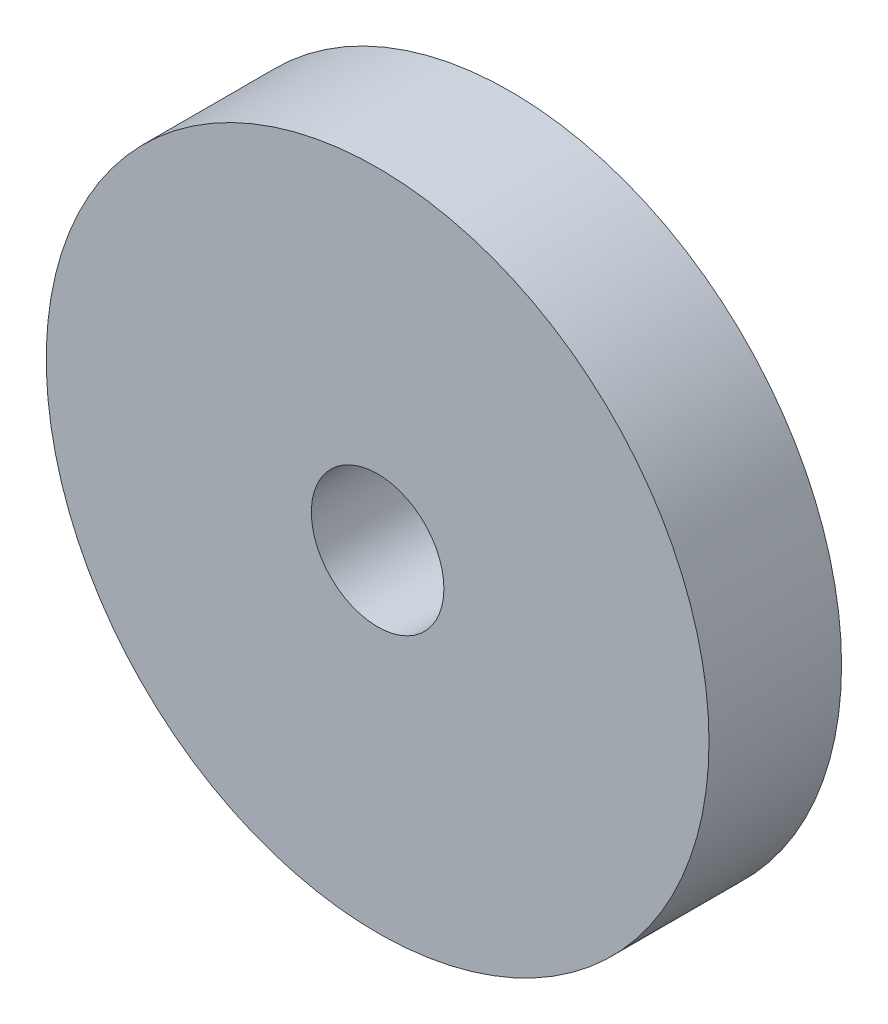
ISO-10303-21;
HEADER;
FILE_DESCRIPTION(('STEP AP214'),'2;1');
FILE_NAME('part.step','',(''),(''),'','','');
FILE_SCHEMA(('AUTOMOTIVE_DESIGN { 1 0 10303 214 1 1 1 1 }'));
ENDSEC;
DATA;
#1=APPLICATION_CONTEXT('core data for automotive mechanical design processes');
#2=APPLICATION_PROTOCOL_DEFINITION('international standard','automotive_design',2000,#1);
#3=PRODUCT_CONTEXT('',#1,'mechanical');
#4=PRODUCT('Part','Part','',(#3));
#5=PRODUCT_RELATED_PRODUCT_CATEGORY('part','',(#4));
#6=PRODUCT_DEFINITION_FORMATION('','',#4);
#7=PRODUCT_DEFINITION_CONTEXT('part definition',#1,'design');
#8=PRODUCT_DEFINITION('design','',#6,#7);
#9=PRODUCT_DEFINITION_SHAPE('','',#8);
#10=(LENGTH_UNIT() NAMED_UNIT(*) SI_UNIT(.MILLI.,.METRE.));
#11=(NAMED_UNIT(*) PLANE_ANGLE_UNIT() SI_UNIT($,.RADIAN.));
#12=(NAMED_UNIT(*) SI_UNIT($,.STERADIAN.) SOLID_ANGLE_UNIT());
#13=UNCERTAINTY_MEASURE_WITH_UNIT(LENGTH_MEASURE(1.E-05),#10,'distance_accuracy_value','');
#14=(GEOMETRIC_REPRESENTATION_CONTEXT(3) GLOBAL_UNCERTAINTY_ASSIGNED_CONTEXT((#13)) GLOBAL_UNIT_ASSIGNED_CONTEXT((#10,
#11,#12)) REPRESENTATION_CONTEXT('',''));
#15=CARTESIAN_POINT('',(0.,0.,0.));
#16=DIRECTION('',(0.,0.,1.));
#17=DIRECTION('',(1.,0.,0.));
#18=AXIS2_PLACEMENT_3D('',#15,#16,#17);
#19=CARTESIAN_POINT('',(0.,0.,2.));
#20=DIRECTION('',(0.,0.,1.));
#21=DIRECTION('',(1.,0.,0.));
#22=AXIS2_PLACEMENT_3D('',#19,#20,#21);
#23=PLANE('',#22);
#24=CARTESIAN_POINT('',(0.,0.,2.));
#25=DIRECTION('',(0.,0.,1.));
#26=DIRECTION('',(1.,0.,0.));
#27=AXIS2_PLACEMENT_3D('',#24,#25,#26);
#28=CIRCLE('',#27,5.);
#29=CARTESIAN_POINT('',(5.,0.,2.));
#30=VERTEX_POINT('',#29);
#31=EDGE_CURVE('E10',#30,#30,#28,.T.);
#32=ORIENTED_EDGE('',*,*,#31,.T.);
#33=EDGE_LOOP('',(#32));
#34=FACE_BOUND('',#33,.T.);
#35=CARTESIAN_POINT('',(0.,0.,2.));
#36=DIRECTION('',(0.,0.,1.));
#37=DIRECTION('',(1.,0.,0.));
#38=AXIS2_PLACEMENT_3D('',#35,#36,#37);
#39=CIRCLE('',#38,1.);
#40=CARTESIAN_POINT('',(1.,0.,2.));
#41=VERTEX_POINT('',#40);
#42=EDGE_CURVE('E42',#41,#41,#39,.T.);
#43=ORIENTED_EDGE('',*,*,#42,.F.);
#44=EDGE_LOOP('',(#43));
#45=FACE_BOUND('',#44,.T.);
#46=ADVANCED_FACE('F31',(#34,#45),#23,.T.);
#47=CARTESIAN_POINT('',(0.,0.,0.));
#48=DIRECTION('',(0.,0.,1.));
#49=DIRECTION('',(1.,0.,0.));
#50=AXIS2_PLACEMENT_3D('',#47,#48,#49);
#51=PLANE('',#50);
#52=CARTESIAN_POINT('',(0.,0.,0.));
#53=DIRECTION('',(0.,0.,1.));
#54=DIRECTION('',(1.,0.,0.));
#55=AXIS2_PLACEMENT_3D('',#52,#53,#54);
#56=CIRCLE('',#55,5.);
#57=CARTESIAN_POINT('',(5.,0.,0.));
#58=VERTEX_POINT('',#57);
#59=EDGE_CURVE('E35',#58,#58,#56,.T.);
#60=ORIENTED_EDGE('',*,*,#59,.F.);
#61=EDGE_LOOP('',(#60));
#62=FACE_BOUND('',#61,.T.);
#63=CARTESIAN_POINT('',(0.,0.,0.));
#64=DIRECTION('',(0.,0.,1.));
#65=DIRECTION('',(1.,0.,0.));
#66=AXIS2_PLACEMENT_3D('',#63,#64,#65);
#67=CIRCLE('',#66,1.);
#68=CARTESIAN_POINT('',(1.,0.,0.));
#69=VERTEX_POINT('',#68);
#70=EDGE_CURVE('E44',#69,#69,#67,.T.);
#71=ORIENTED_EDGE('',*,*,#70,.T.);
#72=EDGE_LOOP('',(#71));
#73=FACE_BOUND('',#72,.T.);
#74=ADVANCED_FACE('F54',(#62,#73),#51,.F.);
#75=CARTESIAN_POINT('',(0.,0.,2.));
#76=DIRECTION('',(0.,0.,-1.));
#77=DIRECTION('',(-1.,0.,0.));
#78=AXIS2_PLACEMENT_3D('',#75,#76,#77);
#79=CYLINDRICAL_SURFACE('',#78,5.);
#80=ORIENTED_EDGE('',*,*,#31,.F.);
#81=EDGE_LOOP('',(#80));
#82=FACE_BOUND('',#81,.T.);
#83=ORIENTED_EDGE('',*,*,#59,.T.);
#84=EDGE_LOOP('',(#83));
#85=FACE_BOUND('',#84,.T.);
#86=ADVANCED_FACE('F33',(#82,#85),#79,.T.);
#87=CARTESIAN_POINT('',(0.,0.,2.));
#88=DIRECTION('',(0.,0.,-1.));
#89=DIRECTION('',(-1.,0.,0.));
#90=AXIS2_PLACEMENT_3D('',#87,#88,#89);
#91=CYLINDRICAL_SURFACE('',#90,1.);
#92=ORIENTED_EDGE('',*,*,#42,.T.);
#93=EDGE_LOOP('',(#92));
#94=FACE_BOUND('',#93,.T.);
#95=ORIENTED_EDGE('',*,*,#70,.F.);
#96=EDGE_LOOP('',(#95));
#97=FACE_BOUND('',#96,.T.);
#98=ADVANCED_FACE('F50',(#94,#97),#91,.F.);
#99=CLOSED_SHELL('',(#46,#74,#86,#98));
#100=MANIFOLD_SOLID_BREP('B2',#99);
#101=ADVANCED_BREP_SHAPE_REPRESENTATION('',(#18,#100),#14);
#102=SHAPE_DEFINITION_REPRESENTATION(#9,#101);
ENDSEC;
END-ISO-10303-21;
